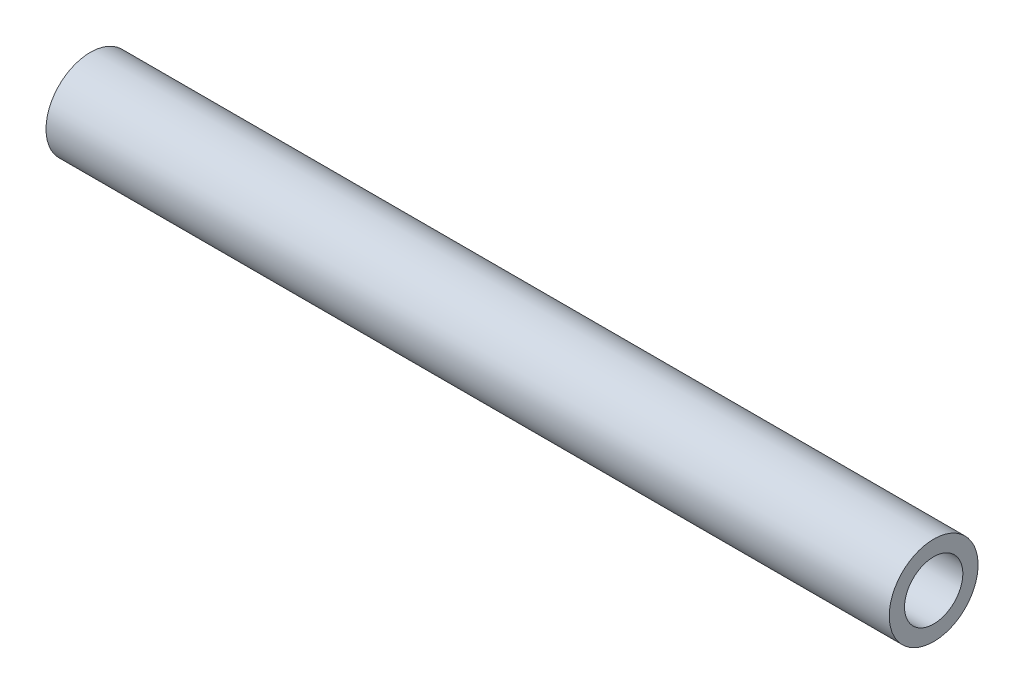
ISO-10303-21;
HEADER;
FILE_DESCRIPTION(('STEP AP214'),'2;1');
FILE_NAME('part.step','',(''),(''),'','','');
FILE_SCHEMA(('AUTOMOTIVE_DESIGN { 1 0 10303 214 1 1 1 1 }'));
ENDSEC;
DATA;
#1=APPLICATION_CONTEXT('core data for automotive mechanical design processes');
#2=APPLICATION_PROTOCOL_DEFINITION('international standard','automotive_design',2000,#1);
#3=PRODUCT_CONTEXT('',#1,'mechanical');
#4=PRODUCT('Part','Part','',(#3));
#5=PRODUCT_RELATED_PRODUCT_CATEGORY('part','',(#4));
#6=PRODUCT_DEFINITION_FORMATION('','',#4);
#7=PRODUCT_DEFINITION_CONTEXT('part definition',#1,'design');
#8=PRODUCT_DEFINITION('design','',#6,#7);
#9=PRODUCT_DEFINITION_SHAPE('','',#8);
#10=(LENGTH_UNIT() NAMED_UNIT(*) SI_UNIT(.MILLI.,.METRE.));
#11=(NAMED_UNIT(*) PLANE_ANGLE_UNIT() SI_UNIT($,.RADIAN.));
#12=(NAMED_UNIT(*) SI_UNIT($,.STERADIAN.) SOLID_ANGLE_UNIT());
#13=UNCERTAINTY_MEASURE_WITH_UNIT(LENGTH_MEASURE(1.E-05),#10,'distance_accuracy_value','');
#14=(GEOMETRIC_REPRESENTATION_CONTEXT(3) GLOBAL_UNCERTAINTY_ASSIGNED_CONTEXT((#13)) GLOBAL_UNIT_ASSIGNED_CONTEXT((#10,
#11,#12)) REPRESENTATION_CONTEXT('',''));
#15=CARTESIAN_POINT('',(0.,0.,0.));
#16=DIRECTION('',(0.,0.,1.));
#17=DIRECTION('',(1.,0.,0.));
#18=AXIS2_PLACEMENT_3D('',#15,#16,#17);
#19=CARTESIAN_POINT('',(45.212,0.,0.));
#20=DIRECTION('',(-1.,0.,0.));
#21=DIRECTION('',(0.,0.,1.));
#22=AXIS2_PLACEMENT_3D('',#19,#20,#21);
#23=CYLINDRICAL_SURFACE('',#22,1.5621);
#24=CARTESIAN_POINT('',(0.,0.,0.));
#25=DIRECTION('',(-1.,0.,0.));
#26=DIRECTION('',(0.,0.,1.));
#27=AXIS2_PLACEMENT_3D('',#24,#25,#26);
#28=CIRCLE('',#27,1.5621);
#29=CARTESIAN_POINT('',(0.,0.,1.5621));
#30=VERTEX_POINT('',#29);
#31=EDGE_CURVE('E26',#30,#30,#28,.T.);
#32=ORIENTED_EDGE('',*,*,#31,.T.);
#33=EDGE_LOOP('',(#32));
#34=FACE_BOUND('',#33,.T.);
#35=CARTESIAN_POINT('',(45.212,0.,0.));
#36=DIRECTION('',(-1.,0.,0.));
#37=DIRECTION('',(0.,0.,1.));
#38=AXIS2_PLACEMENT_3D('',#35,#36,#37);
#39=CIRCLE('',#38,1.5621);
#40=CARTESIAN_POINT('',(45.212,0.,1.5621));
#41=VERTEX_POINT('',#40);
#42=EDGE_CURVE('E17',#41,#41,#39,.T.);
#43=ORIENTED_EDGE('',*,*,#42,.F.);
#44=EDGE_LOOP('',(#43));
#45=FACE_BOUND('',#44,.T.);
#46=ADVANCED_FACE('F14',(#34,#45),#23,.F.);
#47=CARTESIAN_POINT('',(45.212,0.,0.));
#48=DIRECTION('',(1.,0.,0.));
#49=DIRECTION('',(0.,0.,-1.));
#50=AXIS2_PLACEMENT_3D('',#47,#48,#49);
#51=PLANE('',#50);
#52=ORIENTED_EDGE('',*,*,#42,.T.);
#53=EDGE_LOOP('',(#52));
#54=FACE_BOUND('',#53,.T.);
#55=CARTESIAN_POINT('',(45.212,0.,0.));
#56=DIRECTION('',(-1.,0.,0.));
#57=DIRECTION('',(0.,0.,1.));
#58=AXIS2_PLACEMENT_3D('',#55,#56,#57);
#59=CIRCLE('',#58,2.38125);
#60=CARTESIAN_POINT('',(45.212,0.,2.38125));
#61=VERTEX_POINT('',#60);
#62=EDGE_CURVE('E21',#61,#61,#59,.T.);
#63=ORIENTED_EDGE('',*,*,#62,.F.);
#64=EDGE_LOOP('',(#63));
#65=FACE_BOUND('',#64,.T.);
#66=ADVANCED_FACE('F34',(#54,#65),#51,.T.);
#67=CARTESIAN_POINT('',(0.,0.,0.));
#68=DIRECTION('',(1.,0.,0.));
#69=DIRECTION('',(0.,0.,-1.));
#70=AXIS2_PLACEMENT_3D('',#67,#68,#69);
#71=PLANE('',#70);
#72=ORIENTED_EDGE('',*,*,#31,.F.);
#73=EDGE_LOOP('',(#72));
#74=FACE_BOUND('',#73,.T.);
#75=CARTESIAN_POINT('',(0.,0.,0.));
#76=DIRECTION('',(-1.,0.,0.));
#77=DIRECTION('',(0.,0.,1.));
#78=AXIS2_PLACEMENT_3D('',#75,#76,#77);
#79=CIRCLE('',#78,2.38125);
#80=CARTESIAN_POINT('',(0.,0.,2.38125));
#81=VERTEX_POINT('',#80);
#82=EDGE_CURVE('E10',#81,#81,#79,.F.);
#83=ORIENTED_EDGE('',*,*,#82,.F.);
#84=EDGE_LOOP('',(#83));
#85=FACE_BOUND('',#84,.T.);
#86=ADVANCED_FACE('F42',(#74,#85),#71,.F.);
#87=CARTESIAN_POINT('',(45.212,0.,0.));
#88=DIRECTION('',(-1.,0.,0.));
#89=DIRECTION('',(0.,0.,1.));
#90=AXIS2_PLACEMENT_3D('',#87,#88,#89);
#91=CYLINDRICAL_SURFACE('',#90,2.38125);
#92=ORIENTED_EDGE('',*,*,#82,.T.);
#93=EDGE_LOOP('',(#92));
#94=FACE_BOUND('',#93,.T.);
#95=ORIENTED_EDGE('',*,*,#62,.T.);
#96=EDGE_LOOP('',(#95));
#97=FACE_BOUND('',#96,.T.);
#98=ADVANCED_FACE('F43',(#94,#97),#91,.T.);
#99=CLOSED_SHELL('',(#46,#66,#86,#98));
#100=MANIFOLD_SOLID_BREP('B1',#99);
#101=ADVANCED_BREP_SHAPE_REPRESENTATION('',(#18,#100),#14);
#102=SHAPE_DEFINITION_REPRESENTATION(#9,#101);
ENDSEC;
END-ISO-10303-21;
